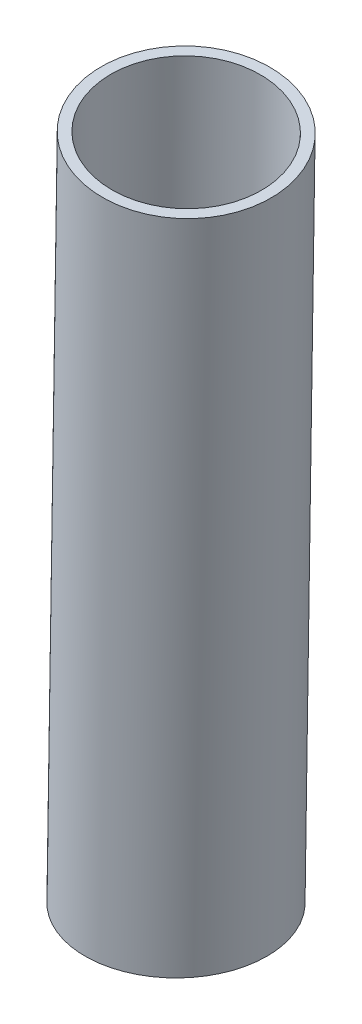
ISO-10303-21;
HEADER;
FILE_DESCRIPTION(('STEP AP214'),'2;1');
FILE_NAME('part.step','',(''),(''),'','','');
FILE_SCHEMA(('AUTOMOTIVE_DESIGN { 1 0 10303 214 1 1 1 1 }'));
ENDSEC;
DATA;
#1=APPLICATION_CONTEXT('core data for automotive mechanical design processes');
#2=APPLICATION_PROTOCOL_DEFINITION('international standard','automotive_design',2000,#1);
#3=PRODUCT_CONTEXT('',#1,'mechanical');
#4=PRODUCT('Part','Part','',(#3));
#5=PRODUCT_RELATED_PRODUCT_CATEGORY('part','',(#4));
#6=PRODUCT_DEFINITION_FORMATION('','',#4);
#7=PRODUCT_DEFINITION_CONTEXT('part definition',#1,'design');
#8=PRODUCT_DEFINITION('design','',#6,#7);
#9=PRODUCT_DEFINITION_SHAPE('','',#8);
#10=(LENGTH_UNIT() NAMED_UNIT(*) SI_UNIT(.MILLI.,.METRE.));
#11=(NAMED_UNIT(*) PLANE_ANGLE_UNIT() SI_UNIT($,.RADIAN.));
#12=(NAMED_UNIT(*) SI_UNIT($,.STERADIAN.) SOLID_ANGLE_UNIT());
#13=UNCERTAINTY_MEASURE_WITH_UNIT(LENGTH_MEASURE(1.E-05),#10,'distance_accuracy_value','');
#14=(GEOMETRIC_REPRESENTATION_CONTEXT(3) GLOBAL_UNCERTAINTY_ASSIGNED_CONTEXT((#13)) GLOBAL_UNIT_ASSIGNED_CONTEXT((#10,
#11,#12)) REPRESENTATION_CONTEXT('',''));
#15=CARTESIAN_POINT('',(0.,0.,0.));
#16=DIRECTION('',(0.,0.,1.));
#17=DIRECTION('',(1.,0.,0.));
#18=AXIS2_PLACEMENT_3D('',#15,#16,#17);
#19=CARTESIAN_POINT('',(0.,0.,0.));
#20=DIRECTION('',(-0.0896417921932544,-0.99309179048572,-0.0757168723749773));
#21=DIRECTION('',(0.99595080938214,-0.0898998625753126,0.));
#22=AXIS2_PLACEMENT_3D('',#19,#20,#21);
#23=CYLINDRICAL_SURFACE('',#22,61.8500000000001);
#24=CARTESIAN_POINT('',(52.5300962790061,581.951856290876,44.3700923251072));
#25=DIRECTION('',(-0.0896417921932544,-0.99309179048572,-0.0757168723749773));
#26=DIRECTION('',(0.99595080938214,-0.0898998625753126,0.));
#27=AXIS2_PLACEMENT_3D('',#24,#25,#26);
#28=CIRCLE('',#27,61.85);
#29=CARTESIAN_POINT('',(114.129653839291,576.391549790593,44.3700923251072));
#30=VERTEX_POINT('',#29);
#31=EDGE_CURVE('E10',#30,#30,#28,.T.);
#32=ORIENTED_EDGE('',*,*,#31,.F.);
#33=EDGE_LOOP('',(#32));
#34=FACE_BOUND('',#33,.T.);
#35=CARTESIAN_POINT('',(2.25663410603291,25.,1.90608947481945));
#36=DIRECTION('',(0.,-1.,0.));
#37=DIRECTION('',(-0.763948584116977,0.,-0.645277119403491));
#38=AXIS2_PLACEMENT_3D('',#35,#36,#37);
#39=ELLIPSE('',#38,62.280244980929,61.8500000000001);
#40=CARTESIAN_POINT('',(-45.3222708656062,25.,-38.2819276022181));
#41=VERTEX_POINT('',#40);
#42=EDGE_CURVE('E50',#41,#41,#39,.T.);
#43=ORIENTED_EDGE('',*,*,#42,.T.);
#44=EDGE_LOOP('',(#43));
#45=FACE_BOUND('',#44,.T.);
#46=ADVANCED_FACE('F36',(#34,#45),#23,.F.);
#47=CARTESIAN_POINT('',(0.,0.,0.));
#48=DIRECTION('',(-0.0896417921932544,-0.99309179048572,-0.0757168723749773));
#49=DIRECTION('',(0.99595080938214,-0.0898998625753126,0.));
#50=AXIS2_PLACEMENT_3D('',#47,#48,#49);
#51=CYLINDRICAL_SURFACE('',#50,69.8499999999999);
#52=CARTESIAN_POINT('',(52.5300962790061,581.951856290876,44.3700923251072));
#53=DIRECTION('',(-0.0896417921932544,-0.99309179048572,-0.0757168723749773));
#54=DIRECTION('',(0.99595080938214,-0.0898998625753126,0.));
#55=AXIS2_PLACEMENT_3D('',#52,#53,#54);
#56=CIRCLE('',#55,69.8499999999998);
#57=CARTESIAN_POINT('',(122.097260314348,575.672350889991,44.3700923251072));
#58=VERTEX_POINT('',#57);
#59=EDGE_CURVE('E45',#58,#58,#56,.T.);
#60=ORIENTED_EDGE('',*,*,#59,.T.);
#61=EDGE_LOOP('',(#60));
#62=FACE_BOUND('',#61,.T.);
#63=CARTESIAN_POINT('',(2.25663410603291,25.,1.90608947481945));
#64=DIRECTION('',(0.,-1.,0.));
#65=DIRECTION('',(-0.763948584116977,0.,-0.645277119403491));
#66=AXIS2_PLACEMENT_3D('',#63,#64,#65);
#67=ELLIPSE('',#66,70.3358950997233,69.8499999999999);
#68=CARTESIAN_POINT('',(-51.4763733680009,25.,-43.4800543057961));
#69=VERTEX_POINT('',#68);
#70=EDGE_CURVE('E40',#69,#69,#67,.F.);
#71=ORIENTED_EDGE('',*,*,#70,.T.);
#72=EDGE_LOOP('',(#71));
#73=FACE_BOUND('',#72,.T.);
#74=ADVANCED_FACE('F61',(#62,#73),#51,.T.);
#75=CARTESIAN_POINT('',(122.098885102871,575.70849739344,43.8940762978303));
#76=DIRECTION('',(0.0896417921932544,0.99309179048572,0.0757168723749773));
#77=DIRECTION('',(-0.99595080938214,0.0898998625753126,0.));
#78=AXIS2_PLACEMENT_3D('',#75,#76,#77);
#79=PLANE('',#78);
#80=ORIENTED_EDGE('',*,*,#31,.T.);
#81=EDGE_LOOP('',(#80));
#82=FACE_BOUND('',#81,.T.);
#83=ORIENTED_EDGE('',*,*,#59,.F.);
#84=EDGE_LOOP('',(#83));
#85=FACE_BOUND('',#84,.T.);
#86=ADVANCED_FACE('F38',(#82,#85),#79,.T.);
#87=CARTESIAN_POINT('',(100.,25.,80.));
#88=DIRECTION('',(0.,-1.,0.));
#89=DIRECTION('',(1.,0.,0.));
#90=AXIS2_PLACEMENT_3D('',#87,#88,#89);
#91=PLANE('',#90);
#92=ORIENTED_EDGE('',*,*,#42,.F.);
#93=EDGE_LOOP('',(#92));
#94=FACE_BOUND('',#93,.T.);
#95=ORIENTED_EDGE('',*,*,#70,.F.);
#96=EDGE_LOOP('',(#95));
#97=FACE_BOUND('',#96,.T.);
#98=ADVANCED_FACE('F63',(#94,#97),#91,.T.);
#99=CLOSED_SHELL('',(#46,#74,#86,#98));
#100=MANIFOLD_SOLID_BREP('B2',#99);
#101=ADVANCED_BREP_SHAPE_REPRESENTATION('',(#18,#100),#14);
#102=SHAPE_DEFINITION_REPRESENTATION(#9,#101);
ENDSEC;
END-ISO-10303-21;
